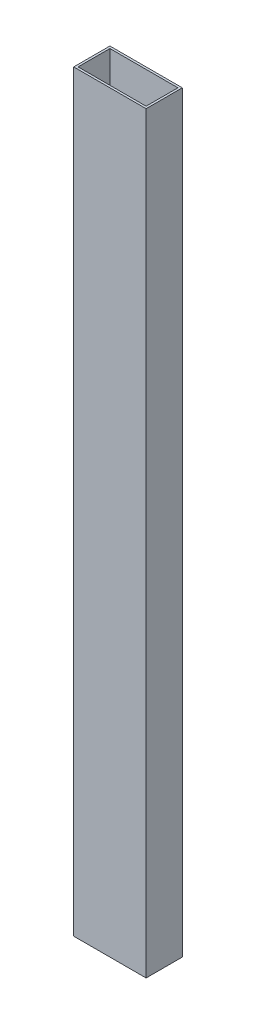
ISO-10303-21;
HEADER;
FILE_DESCRIPTION(('STEP AP214'),'2;1');
FILE_NAME('part.step','',(''),(''),'','','');
FILE_SCHEMA(('AUTOMOTIVE_DESIGN { 1 0 10303 214 1 1 1 1 }'));
ENDSEC;
DATA;
#1=APPLICATION_CONTEXT('core data for automotive mechanical design processes');
#2=APPLICATION_PROTOCOL_DEFINITION('international standard','automotive_design',2000,#1);
#3=PRODUCT_CONTEXT('',#1,'mechanical');
#4=PRODUCT('Part','Part','',(#3));
#5=PRODUCT_RELATED_PRODUCT_CATEGORY('part','',(#4));
#6=PRODUCT_DEFINITION_FORMATION('','',#4);
#7=PRODUCT_DEFINITION_CONTEXT('part definition',#1,'design');
#8=PRODUCT_DEFINITION('design','',#6,#7);
#9=PRODUCT_DEFINITION_SHAPE('','',#8);
#10=(LENGTH_UNIT() NAMED_UNIT(*) SI_UNIT(.MILLI.,.METRE.));
#11=(NAMED_UNIT(*) PLANE_ANGLE_UNIT() SI_UNIT($,.RADIAN.));
#12=(NAMED_UNIT(*) SI_UNIT($,.STERADIAN.) SOLID_ANGLE_UNIT());
#13=UNCERTAINTY_MEASURE_WITH_UNIT(LENGTH_MEASURE(1.E-05),#10,'distance_accuracy_value','');
#14=(GEOMETRIC_REPRESENTATION_CONTEXT(3) GLOBAL_UNCERTAINTY_ASSIGNED_CONTEXT((#13)) GLOBAL_UNIT_ASSIGNED_CONTEXT((#10,
#11,#12)) REPRESENTATION_CONTEXT('',''));
#15=CARTESIAN_POINT('',(0.,0.,0.));
#16=DIRECTION('',(0.,0.,1.));
#17=DIRECTION('',(1.,0.,0.));
#18=AXIS2_PLACEMENT_3D('',#15,#16,#17);
#19=CARTESIAN_POINT('',(0.,528.32,0.));
#20=DIRECTION('',(0.,1.,0.));
#21=DIRECTION('',(0.,0.,1.));
#22=AXIS2_PLACEMENT_3D('',#19,#20,#21);
#23=PLANE('',#22);
#24=DIRECTION('',(0.,0.,1.));
#25=VECTOR('',#24,1.);
#26=CARTESIAN_POINT('',(-9.02676923076922,528.32,-20.7693846153846));
#27=LINE('',#26,#25);
#28=CARTESIAN_POINT('',(-9.02676923076922,528.32,-20.7693846153846));
#29=VERTEX_POINT('',#28);
#30=CARTESIAN_POINT('',(-9.02676923076922,528.32,4.63061538461537));
#31=VERTEX_POINT('',#30);
#32=EDGE_CURVE('E153',#29,#31,#27,.T.);
#33=ORIENTED_EDGE('',*,*,#32,.T.);
#34=DIRECTION('',(1.,0.,0.));
#35=VECTOR('',#34,1.);
#36=CARTESIAN_POINT('',(-9.02676923076922,528.32,4.63061538461537));
#37=LINE('',#36,#35);
#38=CARTESIAN_POINT('',(41.7732307692308,528.32,4.63061538461537));
#39=VERTEX_POINT('',#38);
#40=EDGE_CURVE('E157',#31,#39,#37,.T.);
#41=ORIENTED_EDGE('',*,*,#40,.T.);
#42=DIRECTION('',(0.,0.,-1.));
#43=VECTOR('',#42,1.);
#44=CARTESIAN_POINT('',(41.7732307692308,528.32,-20.7693846153846));
#45=LINE('',#44,#43);
#46=CARTESIAN_POINT('',(41.7732307692308,528.32,-20.7693846153846));
#47=VERTEX_POINT('',#46);
#48=EDGE_CURVE('E161',#39,#47,#45,.T.);
#49=ORIENTED_EDGE('',*,*,#48,.T.);
#50=DIRECTION('',(-1.,0.,0.));
#51=VECTOR('',#50,1.);
#52=CARTESIAN_POINT('',(-9.02676923076922,528.32,-20.7693846153846));
#53=LINE('',#52,#51);
#54=EDGE_CURVE('E164',#47,#29,#53,.T.);
#55=ORIENTED_EDGE('',*,*,#54,.T.);
#56=EDGE_LOOP('',(#33,#41,#49,#55));
#57=FACE_BOUND('',#56,.T.);
#58=DIRECTION('',(1.,0.,0.));
#59=VECTOR('',#58,1.);
#60=CARTESIAN_POINT('',(-7.50276923076921,528.32,3.10661538461538));
#61=LINE('',#60,#59);
#62=CARTESIAN_POINT('',(-7.50276923076921,528.32,3.10661538461538));
#63=VERTEX_POINT('',#62);
#64=CARTESIAN_POINT('',(40.2492307692308,528.32,3.10661538461538));
#65=VERTEX_POINT('',#64);
#66=EDGE_CURVE('E114',#63,#65,#61,.T.);
#67=ORIENTED_EDGE('',*,*,#66,.F.);
#68=DIRECTION('',(0.,0.,1.));
#69=VECTOR('',#68,1.);
#70=CARTESIAN_POINT('',(-7.50276923076922,528.32,-19.2453846153846));
#71=LINE('',#70,#69);
#72=CARTESIAN_POINT('',(-7.50276923076922,528.32,-19.2453846153846));
#73=VERTEX_POINT('',#72);
#74=EDGE_CURVE('E105',#73,#63,#71,.T.);
#75=ORIENTED_EDGE('',*,*,#74,.F.);
#76=DIRECTION('',(-1.,0.,0.));
#77=VECTOR('',#76,1.);
#78=CARTESIAN_POINT('',(-7.50276923076922,528.32,-19.2453846153846));
#79=LINE('',#78,#77);
#80=CARTESIAN_POINT('',(40.2492307692308,528.32,-19.2453846153846));
#81=VERTEX_POINT('',#80);
#82=EDGE_CURVE('E131',#81,#73,#79,.T.);
#83=ORIENTED_EDGE('',*,*,#82,.F.);
#84=DIRECTION('',(0.,0.,-1.));
#85=VECTOR('',#84,1.);
#86=CARTESIAN_POINT('',(40.2492307692308,528.32,-19.2453846153846));
#87=LINE('',#86,#85);
#88=EDGE_CURVE('E127',#65,#81,#87,.T.);
#89=ORIENTED_EDGE('',*,*,#88,.F.);
#90=EDGE_LOOP('',(#67,#75,#83,#89));
#91=FACE_BOUND('',#90,.T.);
#92=ADVANCED_FACE('F39',(#57,#91),#23,.T.);
#93=CARTESIAN_POINT('',(0.,0.,0.));
#94=DIRECTION('',(0.,1.,0.));
#95=DIRECTION('',(0.,0.,1.));
#96=AXIS2_PLACEMENT_3D('',#93,#94,#95);
#97=PLANE('',#96);
#98=DIRECTION('',(0.,0.,1.));
#99=VECTOR('',#98,1.);
#100=CARTESIAN_POINT('',(-9.02676923076922,0.,-20.7693846153846));
#101=LINE('',#100,#99);
#102=CARTESIAN_POINT('',(-9.02676923076922,0.,-20.7693846153846));
#103=VERTEX_POINT('',#102);
#104=CARTESIAN_POINT('',(-9.02676923076922,0.,4.63061538461537));
#105=VERTEX_POINT('',#104);
#106=EDGE_CURVE('E123',#103,#105,#101,.T.);
#107=ORIENTED_EDGE('',*,*,#106,.F.);
#108=DIRECTION('',(-1.,0.,0.));
#109=VECTOR('',#108,1.);
#110=CARTESIAN_POINT('',(-9.02676923076922,0.,-20.7693846153846));
#111=LINE('',#110,#109);
#112=CARTESIAN_POINT('',(41.7732307692308,0.,-20.7693846153846));
#113=VERTEX_POINT('',#112);
#114=EDGE_CURVE('E158',#113,#103,#111,.T.);
#115=ORIENTED_EDGE('',*,*,#114,.F.);
#116=DIRECTION('',(0.,0.,-1.));
#117=VECTOR('',#116,1.);
#118=CARTESIAN_POINT('',(41.7732307692308,0.,-20.7693846153846));
#119=LINE('',#118,#117);
#120=CARTESIAN_POINT('',(41.7732307692308,0.,4.63061538461537));
#121=VERTEX_POINT('',#120);
#122=EDGE_CURVE('E174',#121,#113,#119,.T.);
#123=ORIENTED_EDGE('',*,*,#122,.F.);
#124=DIRECTION('',(1.,0.,0.));
#125=VECTOR('',#124,1.);
#126=CARTESIAN_POINT('',(-9.02676923076922,0.,4.63061538461537));
#127=LINE('',#126,#125);
#128=EDGE_CURVE('E171',#105,#121,#127,.T.);
#129=ORIENTED_EDGE('',*,*,#128,.F.);
#130=EDGE_LOOP('',(#107,#115,#123,#129));
#131=FACE_BOUND('',#130,.T.);
#132=DIRECTION('',(0.,0.,1.));
#133=VECTOR('',#132,1.);
#134=CARTESIAN_POINT('',(-7.50276923076922,0.,-19.2453846153846));
#135=LINE('',#134,#133);
#136=CARTESIAN_POINT('',(-7.50276923076922,0.,-19.2453846153846));
#137=VERTEX_POINT('',#136);
#138=CARTESIAN_POINT('',(-7.50276923076921,0.,3.10661538461538));
#139=VERTEX_POINT('',#138);
#140=EDGE_CURVE('E63',#137,#139,#135,.T.);
#141=ORIENTED_EDGE('',*,*,#140,.T.);
#142=DIRECTION('',(1.,0.,0.));
#143=VECTOR('',#142,1.);
#144=CARTESIAN_POINT('',(-7.50276923076921,0.,3.10661538461538));
#145=LINE('',#144,#143);
#146=CARTESIAN_POINT('',(40.2492307692308,0.,3.10661538461538));
#147=VERTEX_POINT('',#146);
#148=EDGE_CURVE('E121',#139,#147,#145,.T.);
#149=ORIENTED_EDGE('',*,*,#148,.T.);
#150=DIRECTION('',(0.,0.,-1.));
#151=VECTOR('',#150,1.);
#152=CARTESIAN_POINT('',(40.2492307692308,0.,-19.2453846153846));
#153=LINE('',#152,#151);
#154=CARTESIAN_POINT('',(40.2492307692308,0.,-19.2453846153846));
#155=VERTEX_POINT('',#154);
#156=EDGE_CURVE('E140',#147,#155,#153,.T.);
#157=ORIENTED_EDGE('',*,*,#156,.T.);
#158=DIRECTION('',(-1.,0.,0.));
#159=VECTOR('',#158,1.);
#160=CARTESIAN_POINT('',(-7.50276923076922,0.,-19.2453846153846));
#161=LINE('',#160,#159);
#162=EDGE_CURVE('E115',#155,#137,#161,.T.);
#163=ORIENTED_EDGE('',*,*,#162,.T.);
#164=EDGE_LOOP('',(#141,#149,#157,#163));
#165=FACE_BOUND('',#164,.T.);
#166=ADVANCED_FACE('F197',(#131,#165),#97,.F.);
#167=CARTESIAN_POINT('',(-9.02676923076922,528.32,-20.7693846153846));
#168=DIRECTION('',(1.,0.,0.));
#169=DIRECTION('',(0.,0.,-1.));
#170=AXIS2_PLACEMENT_3D('',#167,#168,#169);
#171=PLANE('',#170);
#172=ORIENTED_EDGE('',*,*,#106,.T.);
#173=DIRECTION('',(0.,-1.,0.));
#174=VECTOR('',#173,1.);
#175=CARTESIAN_POINT('',(-9.02676923076922,528.32,4.63061538461537));
#176=LINE('',#175,#174);
#177=EDGE_CURVE('E11',#31,#105,#176,.T.);
#178=ORIENTED_EDGE('',*,*,#177,.F.);
#179=ORIENTED_EDGE('',*,*,#32,.F.);
#180=DIRECTION('',(0.,-1.,0.));
#181=VECTOR('',#180,1.);
#182=CARTESIAN_POINT('',(-9.02676923076922,528.32,-20.7693846153846));
#183=LINE('',#182,#181);
#184=EDGE_CURVE('E167',#29,#103,#183,.T.);
#185=ORIENTED_EDGE('',*,*,#184,.T.);
#186=EDGE_LOOP('',(#172,#178,#179,#185));
#187=FACE_BOUND('',#186,.T.);
#188=ADVANCED_FACE('F41',(#187),#171,.F.);
#189=CARTESIAN_POINT('',(-9.02676923076922,528.32,4.63061538461537));
#190=DIRECTION('',(0.,0.,-1.));
#191=DIRECTION('',(-1.,0.,0.));
#192=AXIS2_PLACEMENT_3D('',#189,#190,#191);
#193=PLANE('',#192);
#194=ORIENTED_EDGE('',*,*,#128,.T.);
#195=DIRECTION('',(0.,-1.,0.));
#196=VECTOR('',#195,1.);
#197=CARTESIAN_POINT('',(41.7732307692308,528.32,4.63061538461537));
#198=LINE('',#197,#196);
#199=EDGE_CURVE('E48',#39,#121,#198,.T.);
#200=ORIENTED_EDGE('',*,*,#199,.F.);
#201=ORIENTED_EDGE('',*,*,#40,.F.);
#202=ORIENTED_EDGE('',*,*,#177,.T.);
#203=EDGE_LOOP('',(#194,#200,#201,#202));
#204=FACE_BOUND('',#203,.T.);
#205=ADVANCED_FACE('F207',(#204),#193,.F.);
#206=CARTESIAN_POINT('',(41.7732307692308,528.32,-20.7693846153846));
#207=DIRECTION('',(-1.,0.,0.));
#208=DIRECTION('',(0.,0.,1.));
#209=AXIS2_PLACEMENT_3D('',#206,#207,#208);
#210=PLANE('',#209);
#211=ORIENTED_EDGE('',*,*,#122,.T.);
#212=DIRECTION('',(0.,-1.,0.));
#213=VECTOR('',#212,1.);
#214=CARTESIAN_POINT('',(41.7732307692308,528.32,-20.7693846153846));
#215=LINE('',#214,#213);
#216=EDGE_CURVE('E182',#47,#113,#215,.T.);
#217=ORIENTED_EDGE('',*,*,#216,.F.);
#218=ORIENTED_EDGE('',*,*,#48,.F.);
#219=ORIENTED_EDGE('',*,*,#199,.T.);
#220=EDGE_LOOP('',(#211,#217,#218,#219));
#221=FACE_BOUND('',#220,.T.);
#222=ADVANCED_FACE('F191',(#221),#210,.F.);
#223=CARTESIAN_POINT('',(-9.02676923076922,528.32,-20.7693846153846));
#224=DIRECTION('',(0.,0.,1.));
#225=DIRECTION('',(1.,0.,0.));
#226=AXIS2_PLACEMENT_3D('',#223,#224,#225);
#227=PLANE('',#226);
#228=ORIENTED_EDGE('',*,*,#114,.T.);
#229=ORIENTED_EDGE('',*,*,#184,.F.);
#230=ORIENTED_EDGE('',*,*,#54,.F.);
#231=ORIENTED_EDGE('',*,*,#216,.T.);
#232=EDGE_LOOP('',(#228,#229,#230,#231));
#233=FACE_BOUND('',#232,.T.);
#234=ADVANCED_FACE('F201',(#233),#227,.F.);
#235=CARTESIAN_POINT('',(-7.50276923076922,528.32,-19.2453846153846));
#236=DIRECTION('',(1.,0.,0.));
#237=DIRECTION('',(0.,0.,-1.));
#238=AXIS2_PLACEMENT_3D('',#235,#236,#237);
#239=PLANE('',#238);
#240=ORIENTED_EDGE('',*,*,#140,.F.);
#241=DIRECTION('',(0.,-1.,0.));
#242=VECTOR('',#241,1.);
#243=CARTESIAN_POINT('',(-7.50276923076922,528.32,-19.2453846153846));
#244=LINE('',#243,#242);
#245=EDGE_CURVE('E109',#73,#137,#244,.T.);
#246=ORIENTED_EDGE('',*,*,#245,.F.);
#247=ORIENTED_EDGE('',*,*,#74,.T.);
#248=DIRECTION('',(0.,-1.,0.));
#249=VECTOR('',#248,1.);
#250=CARTESIAN_POINT('',(-7.50276923076921,528.32,3.10661538461538));
#251=LINE('',#250,#249);
#252=EDGE_CURVE('E108',#63,#139,#251,.T.);
#253=ORIENTED_EDGE('',*,*,#252,.T.);
#254=EDGE_LOOP('',(#240,#246,#247,#253));
#255=FACE_BOUND('',#254,.T.);
#256=ADVANCED_FACE('F107',(#255),#239,.T.);
#257=CARTESIAN_POINT('',(-7.50276923076921,528.32,3.10661538461538));
#258=DIRECTION('',(0.,0.,-1.));
#259=DIRECTION('',(-1.,0.,0.));
#260=AXIS2_PLACEMENT_3D('',#257,#258,#259);
#261=PLANE('',#260);
#262=ORIENTED_EDGE('',*,*,#148,.F.);
#263=ORIENTED_EDGE('',*,*,#252,.F.);
#264=ORIENTED_EDGE('',*,*,#66,.T.);
#265=DIRECTION('',(0.,-1.,0.));
#266=VECTOR('',#265,1.);
#267=CARTESIAN_POINT('',(40.2492307692308,528.32,3.10661538461538));
#268=LINE('',#267,#266);
#269=EDGE_CURVE('E124',#65,#147,#268,.T.);
#270=ORIENTED_EDGE('',*,*,#269,.T.);
#271=EDGE_LOOP('',(#262,#263,#264,#270));
#272=FACE_BOUND('',#271,.T.);
#273=ADVANCED_FACE('F118',(#272),#261,.T.);
#274=CARTESIAN_POINT('',(40.2492307692308,528.32,-19.2453846153846));
#275=DIRECTION('',(-1.,0.,0.));
#276=DIRECTION('',(0.,0.,1.));
#277=AXIS2_PLACEMENT_3D('',#274,#275,#276);
#278=PLANE('',#277);
#279=ORIENTED_EDGE('',*,*,#156,.F.);
#280=ORIENTED_EDGE('',*,*,#269,.F.);
#281=ORIENTED_EDGE('',*,*,#88,.T.);
#282=DIRECTION('',(0.,-1.,0.));
#283=VECTOR('',#282,1.);
#284=CARTESIAN_POINT('',(40.2492307692308,528.32,-19.2453846153846));
#285=LINE('',#284,#283);
#286=EDGE_CURVE('E55',#81,#155,#285,.T.);
#287=ORIENTED_EDGE('',*,*,#286,.T.);
#288=EDGE_LOOP('',(#279,#280,#281,#287));
#289=FACE_BOUND('',#288,.T.);
#290=ADVANCED_FACE('F230',(#289),#278,.T.);
#291=CARTESIAN_POINT('',(-7.50276923076922,528.32,-19.2453846153846));
#292=DIRECTION('',(0.,0.,1.));
#293=DIRECTION('',(1.,0.,0.));
#294=AXIS2_PLACEMENT_3D('',#291,#292,#293);
#295=PLANE('',#294);
#296=ORIENTED_EDGE('',*,*,#162,.F.);
#297=ORIENTED_EDGE('',*,*,#286,.F.);
#298=ORIENTED_EDGE('',*,*,#82,.T.);
#299=ORIENTED_EDGE('',*,*,#245,.T.);
#300=EDGE_LOOP('',(#296,#297,#298,#299));
#301=FACE_BOUND('',#300,.T.);
#302=ADVANCED_FACE('F234',(#301),#295,.T.);
#303=CLOSED_SHELL('',(#92,#166,#188,#205,#222,#234,#256,#273,#290,#302));
#304=MANIFOLD_SOLID_BREP('B2',#303);
#305=ADVANCED_BREP_SHAPE_REPRESENTATION('',(#18,#304),#14);
#306=SHAPE_DEFINITION_REPRESENTATION(#9,#305);
ENDSEC;
END-ISO-10303-21;
